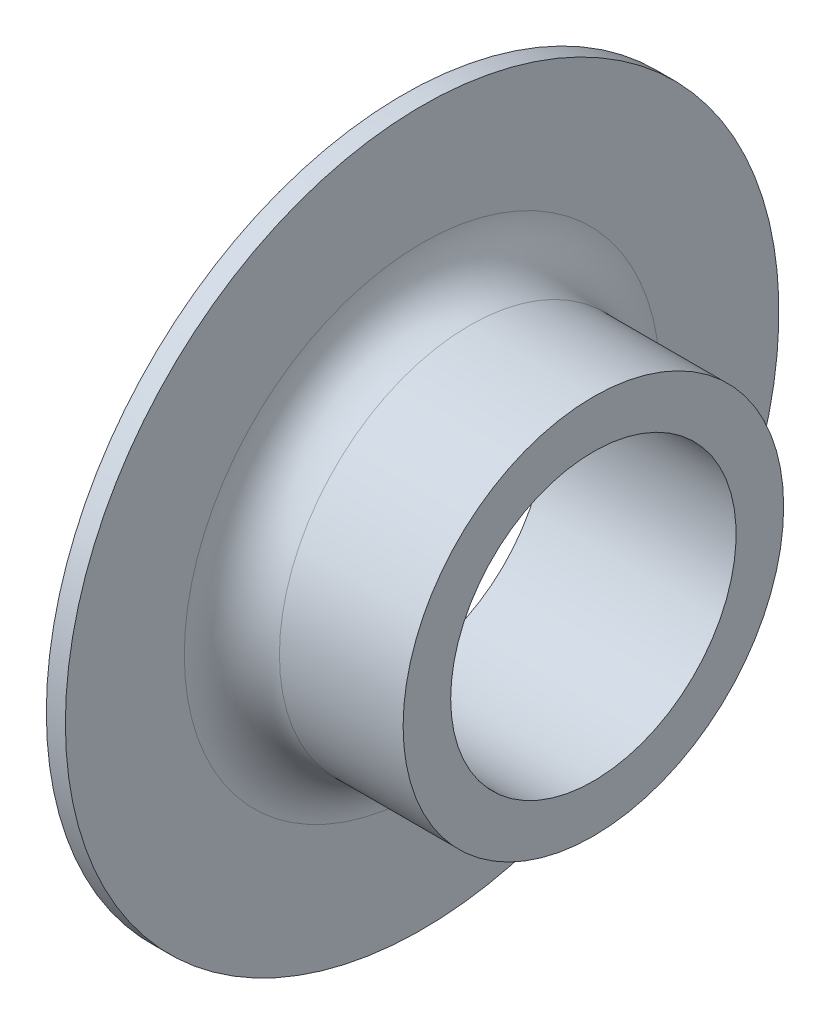
ISO-10303-21;
HEADER;
FILE_DESCRIPTION(('STEP AP214'),'2;1');
FILE_NAME('part.step','',(''),(''),'','','');
FILE_SCHEMA(('AUTOMOTIVE_DESIGN { 1 0 10303 214 1 1 1 1 }'));
ENDSEC;
DATA;
#1=APPLICATION_CONTEXT('core data for automotive mechanical design processes');
#2=APPLICATION_PROTOCOL_DEFINITION('international standard','automotive_design',2000,#1);
#3=PRODUCT_CONTEXT('',#1,'mechanical');
#4=PRODUCT('Part','Part','',(#3));
#5=PRODUCT_RELATED_PRODUCT_CATEGORY('part','',(#4));
#6=PRODUCT_DEFINITION_FORMATION('','',#4);
#7=PRODUCT_DEFINITION_CONTEXT('part definition',#1,'design');
#8=PRODUCT_DEFINITION('design','',#6,#7);
#9=PRODUCT_DEFINITION_SHAPE('','',#8);
#10=(LENGTH_UNIT() NAMED_UNIT(*) SI_UNIT(.MILLI.,.METRE.));
#11=(NAMED_UNIT(*) PLANE_ANGLE_UNIT() SI_UNIT($,.RADIAN.));
#12=(NAMED_UNIT(*) SI_UNIT($,.STERADIAN.) SOLID_ANGLE_UNIT());
#13=UNCERTAINTY_MEASURE_WITH_UNIT(LENGTH_MEASURE(1.E-05),#10,'distance_accuracy_value','');
#14=(GEOMETRIC_REPRESENTATION_CONTEXT(3) GLOBAL_UNCERTAINTY_ASSIGNED_CONTEXT((#13)) GLOBAL_UNIT_ASSIGNED_CONTEXT((#10,
#11,#12)) REPRESENTATION_CONTEXT('',''));
#15=CARTESIAN_POINT('',(0.,0.,0.));
#16=DIRECTION('',(0.,0.,1.));
#17=DIRECTION('',(1.,0.,0.));
#18=AXIS2_PLACEMENT_3D('',#15,#16,#17);
#19=CARTESIAN_POINT('',(0.,15.,0.));
#20=DIRECTION('',(1.,0.,0.));
#21=DIRECTION('',(0.,0.,-1.));
#22=AXIS2_PLACEMENT_3D('',#19,#20,#21);
#23=PLANE('',#22);
#24=CARTESIAN_POINT('',(0.,0.,0.));
#25=DIRECTION('',(-1.,0.,0.));
#26=DIRECTION('',(0.,0.,1.));
#27=AXIS2_PLACEMENT_3D('',#24,#25,#26);
#28=CIRCLE('',#27,15.);
#29=CARTESIAN_POINT('',(0.,0.,15.));
#30=VERTEX_POINT('',#29);
#31=EDGE_CURVE('E58',#30,#30,#28,.T.);
#32=ORIENTED_EDGE('',*,*,#31,.F.);
#33=EDGE_LOOP('',(#32));
#34=FACE_BOUND('',#33,.T.);
#35=CARTESIAN_POINT('',(0.,0.,0.));
#36=DIRECTION('',(-1.,0.,0.));
#37=DIRECTION('',(0.,0.,1.));
#38=AXIS2_PLACEMENT_3D('',#35,#36,#37);
#39=CIRCLE('',#38,37.5);
#40=CARTESIAN_POINT('',(0.,0.,37.5));
#41=VERTEX_POINT('',#40);
#42=EDGE_CURVE('E43',#41,#41,#39,.T.);
#43=ORIENTED_EDGE('',*,*,#42,.T.);
#44=EDGE_LOOP('',(#43));
#45=FACE_BOUND('',#44,.T.);
#46=ADVANCED_FACE('F32',(#34,#45),#23,.F.);
#47=CARTESIAN_POINT('',(0.,0.,0.));
#48=DIRECTION('',(-1.,0.,0.));
#49=DIRECTION('',(0.,0.,1.));
#50=AXIS2_PLACEMENT_3D('',#47,#48,#49);
#51=CYLINDRICAL_SURFACE('',#50,37.5);
#52=ORIENTED_EDGE('',*,*,#42,.F.);
#53=EDGE_LOOP('',(#52));
#54=FACE_BOUND('',#53,.T.);
#55=CARTESIAN_POINT('',(1.99999999999998,0.,0.));
#56=DIRECTION('',(-1.,0.,0.));
#57=DIRECTION('',(0.,0.,1.));
#58=AXIS2_PLACEMENT_3D('',#55,#56,#57);
#59=CIRCLE('',#58,37.5);
#60=CARTESIAN_POINT('',(1.99999999999998,0.,37.5));
#61=VERTEX_POINT('',#60);
#62=EDGE_CURVE('E47',#61,#61,#59,.T.);
#63=ORIENTED_EDGE('',*,*,#62,.T.);
#64=EDGE_LOOP('',(#63));
#65=FACE_BOUND('',#64,.T.);
#66=ADVANCED_FACE('F66',(#54,#65),#51,.T.);
#67=CARTESIAN_POINT('',(1.99999999999999,37.5,0.));
#68=DIRECTION('',(-1.,0.,0.));
#69=DIRECTION('',(0.,0.,1.));
#70=AXIS2_PLACEMENT_3D('',#67,#68,#69);
#71=PLANE('',#70);
#72=CARTESIAN_POINT('',(1.99999999999999,0.,0.));
#73=DIRECTION('',(-1.,0.,0.));
#74=DIRECTION('',(0.,0.,1.));
#75=AXIS2_PLACEMENT_3D('',#72,#73,#74);
#76=CIRCLE('',#75,25.);
#77=CARTESIAN_POINT('',(1.99999999999999,0.,25.));
#78=VERTEX_POINT('',#77);
#79=EDGE_CURVE('E39',#78,#78,#76,.T.);
#80=ORIENTED_EDGE('',*,*,#79,.T.);
#81=EDGE_LOOP('',(#80));
#82=FACE_BOUND('',#81,.T.);
#83=ORIENTED_EDGE('',*,*,#62,.F.);
#84=EDGE_LOOP('',(#83));
#85=FACE_BOUND('',#84,.T.);
#86=ADVANCED_FACE('F71',(#82,#85),#71,.F.);
#87=CARTESIAN_POINT('',(0.,0.,0.));
#88=DIRECTION('',(-1.,0.,0.));
#89=DIRECTION('',(0.,0.,1.));
#90=AXIS2_PLACEMENT_3D('',#87,#88,#89);
#91=CYLINDRICAL_SURFACE('',#90,20.);
#92=CARTESIAN_POINT('',(6.99999999999999,0.,0.));
#93=DIRECTION('',(-1.,0.,0.));
#94=DIRECTION('',(0.,0.,1.));
#95=AXIS2_PLACEMENT_3D('',#92,#93,#94);
#96=CIRCLE('',#95,20.);
#97=CARTESIAN_POINT('',(6.99999999999999,0.,20.));
#98=VERTEX_POINT('',#97);
#99=EDGE_CURVE('E10',#98,#98,#96,.F.);
#100=ORIENTED_EDGE('',*,*,#99,.T.);
#101=EDGE_LOOP('',(#100));
#102=FACE_BOUND('',#101,.T.);
#103=CARTESIAN_POINT('',(20.,0.,0.));
#104=DIRECTION('',(-1.,0.,0.));
#105=DIRECTION('',(0.,0.,1.));
#106=AXIS2_PLACEMENT_3D('',#103,#104,#105);
#107=CIRCLE('',#106,20.);
#108=CARTESIAN_POINT('',(20.,0.,20.));
#109=VERTEX_POINT('',#108);
#110=EDGE_CURVE('E52',#109,#109,#107,.T.);
#111=ORIENTED_EDGE('',*,*,#110,.T.);
#112=EDGE_LOOP('',(#111));
#113=FACE_BOUND('',#112,.T.);
#114=ADVANCED_FACE('F76',(#102,#113),#91,.T.);
#115=CARTESIAN_POINT('',(20.,20.,0.));
#116=DIRECTION('',(-1.,0.,0.));
#117=DIRECTION('',(0.,0.,1.));
#118=AXIS2_PLACEMENT_3D('',#115,#116,#117);
#119=PLANE('',#118);
#120=ORIENTED_EDGE('',*,*,#110,.F.);
#121=EDGE_LOOP('',(#120));
#122=FACE_BOUND('',#121,.T.);
#123=CARTESIAN_POINT('',(20.,0.,0.));
#124=DIRECTION('',(-1.,0.,0.));
#125=DIRECTION('',(0.,0.,1.));
#126=AXIS2_PLACEMENT_3D('',#123,#124,#125);
#127=CIRCLE('',#126,15.);
#128=CARTESIAN_POINT('',(20.,0.,15.));
#129=VERTEX_POINT('',#128);
#130=EDGE_CURVE('E55',#129,#129,#127,.T.);
#131=ORIENTED_EDGE('',*,*,#130,.T.);
#132=EDGE_LOOP('',(#131));
#133=FACE_BOUND('',#132,.T.);
#134=ADVANCED_FACE('F81',(#122,#133),#119,.F.);
#135=CARTESIAN_POINT('',(0.,0.,0.));
#136=DIRECTION('',(-1.,0.,0.));
#137=DIRECTION('',(0.,0.,1.));
#138=AXIS2_PLACEMENT_3D('',#135,#136,#137);
#139=CYLINDRICAL_SURFACE('',#138,15.);
#140=ORIENTED_EDGE('',*,*,#130,.F.);
#141=EDGE_LOOP('',(#140));
#142=FACE_BOUND('',#141,.T.);
#143=ORIENTED_EDGE('',*,*,#31,.T.);
#144=EDGE_LOOP('',(#143));
#145=FACE_BOUND('',#144,.T.);
#146=ADVANCED_FACE('F62',(#142,#145),#139,.F.);
#147=CARTESIAN_POINT('',(6.99999999999999,0.,0.));
#148=DIRECTION('',(-1.,0.,0.));
#149=DIRECTION('',(0.,0.,1.));
#150=AXIS2_PLACEMENT_3D('',#147,#148,#149);
#151=TOROIDAL_SURFACE('',#150,25.,5.);
#152=ORIENTED_EDGE('',*,*,#99,.F.);
#153=EDGE_LOOP('',(#152));
#154=FACE_BOUND('',#153,.T.);
#155=ORIENTED_EDGE('',*,*,#79,.F.);
#156=EDGE_LOOP('',(#155));
#157=FACE_BOUND('',#156,.T.);
#158=ADVANCED_FACE('F34',(#154,#157),#151,.F.);
#159=CLOSED_SHELL('',(#46,#66,#86,#114,#134,#146,#158));
#160=MANIFOLD_SOLID_BREP('B2',#159);
#161=ADVANCED_BREP_SHAPE_REPRESENTATION('',(#18,#160),#14);
#162=SHAPE_DEFINITION_REPRESENTATION(#9,#161);
ENDSEC;
END-ISO-10303-21;
